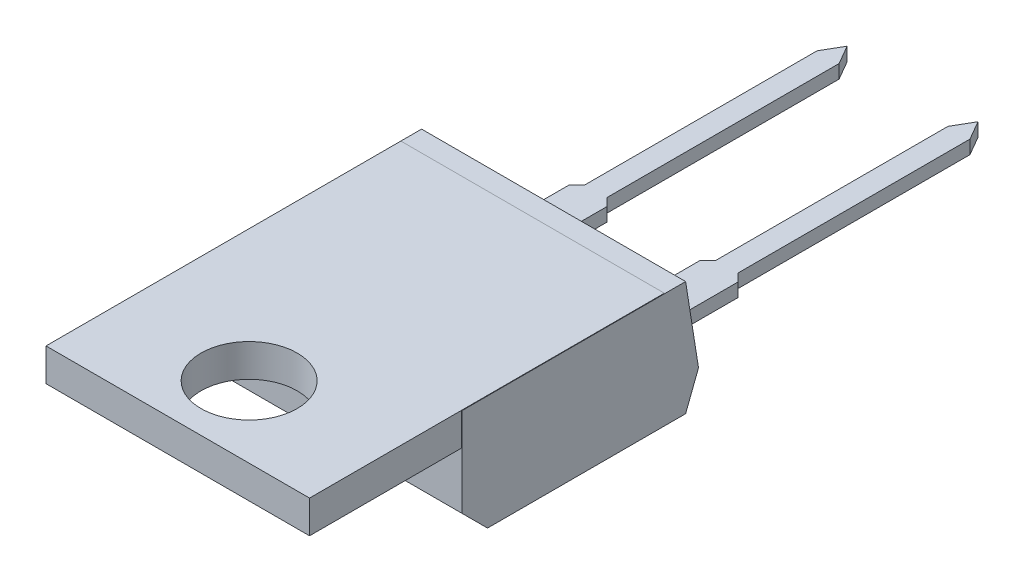
ISO-10303-21;
HEADER;
FILE_DESCRIPTION(('STEP AP214'),'2;1');
FILE_NAME('part.step','',(''),(''),'','','');
FILE_SCHEMA(('AUTOMOTIVE_DESIGN { 1 0 10303 214 1 1 1 1 }'));
ENDSEC;
DATA;
#1=APPLICATION_CONTEXT('core data for automotive mechanical design processes');
#2=APPLICATION_PROTOCOL_DEFINITION('international standard','automotive_design',2000,#1);
#3=PRODUCT_CONTEXT('',#1,'mechanical');
#4=PRODUCT('Part','Part','',(#3));
#5=PRODUCT_RELATED_PRODUCT_CATEGORY('part','',(#4));
#6=PRODUCT_DEFINITION_FORMATION('','',#4);
#7=PRODUCT_DEFINITION_CONTEXT('part definition',#1,'design');
#8=PRODUCT_DEFINITION('design','',#6,#7);
#9=PRODUCT_DEFINITION_SHAPE('','',#8);
#10=(LENGTH_UNIT() NAMED_UNIT(*) SI_UNIT(.MILLI.,.METRE.));
#11=(NAMED_UNIT(*) PLANE_ANGLE_UNIT() SI_UNIT($,.RADIAN.));
#12=(NAMED_UNIT(*) SI_UNIT($,.STERADIAN.) SOLID_ANGLE_UNIT());
#13=UNCERTAINTY_MEASURE_WITH_UNIT(LENGTH_MEASURE(1.E-05),#10,'distance_accuracy_value','');
#14=(GEOMETRIC_REPRESENTATION_CONTEXT(3) GLOBAL_UNCERTAINTY_ASSIGNED_CONTEXT((#13)) GLOBAL_UNIT_ASSIGNED_CONTEXT((#10,
#11,#12)) REPRESENTATION_CONTEXT('',''));
#15=CARTESIAN_POINT('',(0.,0.,0.));
#16=DIRECTION('',(0.,0.,1.));
#17=DIRECTION('',(1.,0.,0.));
#18=AXIS2_PLACEMENT_3D('',#15,#16,#17);
#19=CARTESIAN_POINT('',(-0.73,0.2625,0.302499999998));
#20=DIRECTION('',(0.,-1.,0.));
#21=DIRECTION('',(0.,0.,-1.));
#22=AXIS2_PLACEMENT_3D('',#19,#20,#21);
#23=PLANE('',#22);
#24=DIRECTION('',(0.,0.,1.));
#25=VECTOR('',#24,1.);
#26=CARTESIAN_POINT('',(0.73,0.2625,0.302499999998));
#27=LINE('',#26,#25);
#28=CARTESIAN_POINT('',(0.73,0.262500000000055,3.72666666666666));
#29=VERTEX_POINT('',#28);
#30=CARTESIAN_POINT('',(0.730000000000017,0.2625,0.302499999997983));
#31=VERTEX_POINT('',#30);
#32=EDGE_CURVE('E299',#29,#31,#27,.F.);
#33=ORIENTED_EDGE('',*,*,#32,.T.);
#34=DIRECTION('',(0.707106781189048,0.,0.707106781184048));
#35=VECTOR('',#34,1.);
#36=CARTESIAN_POINT('',(0.4275,0.2625,0.));
#37=LINE('',#36,#35);
#38=CARTESIAN_POINT('',(0.4275,0.2625,0.));
#39=VERTEX_POINT('',#38);
#40=EDGE_CURVE('E301',#31,#39,#37,.F.);
#41=ORIENTED_EDGE('',*,*,#40,.T.);
#42=DIRECTION('',(0.,0.,1.));
#43=VECTOR('',#42,1.);
#44=CARTESIAN_POINT('',(0.4275,0.2625,-9.009548279765));
#45=LINE('',#44,#43);
#46=CARTESIAN_POINT('',(0.427499999999931,0.262499999999999,-9.00954827976496));
#47=VERTEX_POINT('',#46);
#48=EDGE_CURVE('E306',#39,#47,#45,.F.);
#49=ORIENTED_EDGE('',*,*,#48,.T.);
#50=DIRECTION('',(0.50000000000019,0.,0.866025403784329));
#51=VECTOR('',#50,1.);
#52=CARTESIAN_POINT('',(0.,0.2625,-9.75));
#53=LINE('',#52,#51);
#54=CARTESIAN_POINT('',(0.,0.262499999999998,-9.75000000000004));
#55=VERTEX_POINT('',#54);
#56=EDGE_CURVE('E311',#47,#55,#53,.F.);
#57=ORIENTED_EDGE('',*,*,#56,.T.);
#58=DIRECTION('',(0.50000000000019,0.,-0.866025403784329));
#59=VECTOR('',#58,1.);
#60=CARTESIAN_POINT('',(-0.4275,0.2625,-9.009548279765));
#61=LINE('',#60,#59);
#62=CARTESIAN_POINT('',(-0.4275,0.262499999999999,-9.009548279765));
#63=VERTEX_POINT('',#62);
#64=EDGE_CURVE('E251',#55,#63,#61,.F.);
#65=ORIENTED_EDGE('',*,*,#64,.T.);
#66=DIRECTION('',(0.,0.,-1.));
#67=VECTOR('',#66,1.);
#68=CARTESIAN_POINT('',(-0.4275,0.2625,0.));
#69=LINE('',#68,#67);
#70=CARTESIAN_POINT('',(-0.427499999999965,0.2625,0.));
#71=VERTEX_POINT('',#70);
#72=EDGE_CURVE('E234',#63,#71,#69,.F.);
#73=ORIENTED_EDGE('',*,*,#72,.T.);
#74=DIRECTION('',(0.707106781189048,0.,-0.707106781184048));
#75=VECTOR('',#74,1.);
#76=CARTESIAN_POINT('',(-0.73,0.2625,0.302499999998));
#77=LINE('',#76,#75);
#78=CARTESIAN_POINT('',(-0.73,0.2625,0.302499999998));
#79=VERTEX_POINT('',#78);
#80=EDGE_CURVE('E239',#71,#79,#77,.F.);
#81=ORIENTED_EDGE('',*,*,#80,.T.);
#82=DIRECTION('',(0.,0.,-1.));
#83=VECTOR('',#82,1.);
#84=CARTESIAN_POINT('',(-0.73,0.2625,3.73));
#85=LINE('',#84,#83);
#86=CARTESIAN_POINT('',(-0.73,0.262500000000055,3.72666666666666));
#87=VERTEX_POINT('',#86);
#88=EDGE_CURVE('E275',#79,#87,#85,.F.);
#89=ORIENTED_EDGE('',*,*,#88,.T.);
#90=DIRECTION('',(1.,0.,0.));
#91=VECTOR('',#90,1.);
#92=CARTESIAN_POINT('',(-0.73,0.262500000000002,3.726666666667));
#93=LINE('',#92,#91);
#94=EDGE_CURVE('E263',#29,#87,#93,.F.);
#95=ORIENTED_EDGE('',*,*,#94,.F.);
#96=EDGE_LOOP('',(#33,#41,#49,#57,#65,#73,#81,#89,#95));
#97=FACE_BOUND('',#96,.T.);
#98=ADVANCED_FACE('F16',(#97),#23,.F.);
#99=CARTESIAN_POINT('',(4.35,0.2625,0.3025));
#100=DIRECTION('',(0.,-1.,0.));
#101=DIRECTION('',(0.,0.,-1.));
#102=AXIS2_PLACEMENT_3D('',#99,#100,#101);
#103=PLANE('',#102);
#104=DIRECTION('',(0.,0.,1.));
#105=VECTOR('',#104,1.);
#106=CARTESIAN_POINT('',(5.81,0.2625,0.3025));
#107=LINE('',#106,#105);
#108=CARTESIAN_POINT('',(5.81,0.262500000000055,3.72666666666666));
#109=VERTEX_POINT('',#108);
#110=CARTESIAN_POINT('',(5.81,0.2625,0.3025));
#111=VERTEX_POINT('',#110);
#112=EDGE_CURVE('E355',#109,#111,#107,.F.);
#113=ORIENTED_EDGE('',*,*,#112,.T.);
#114=DIRECTION('',(0.707106781186548,0.,0.707106781186548));
#115=VECTOR('',#114,1.);
#116=CARTESIAN_POINT('',(5.5075,0.2625,0.));
#117=LINE('',#116,#115);
#118=CARTESIAN_POINT('',(5.5075,0.2625,0.));
#119=VERTEX_POINT('',#118);
#120=EDGE_CURVE('E357',#111,#119,#117,.F.);
#121=ORIENTED_EDGE('',*,*,#120,.T.);
#122=DIRECTION('',(0.,0.,1.));
#123=VECTOR('',#122,1.);
#124=CARTESIAN_POINT('',(5.5075,0.2625,-9.009548279765));
#125=LINE('',#124,#123);
#126=CARTESIAN_POINT('',(5.50749999999993,0.262499999999999,-9.00954827976496));
#127=VERTEX_POINT('',#126);
#128=EDGE_CURVE('E362',#119,#127,#125,.F.);
#129=ORIENTED_EDGE('',*,*,#128,.T.);
#130=DIRECTION('',(0.50000000000019,0.,0.866025403784329));
#131=VECTOR('',#130,1.);
#132=CARTESIAN_POINT('',(5.08,0.2625,-9.75));
#133=LINE('',#132,#131);
#134=CARTESIAN_POINT('',(5.07999999999993,0.262499999999998,-9.75000000000004));
#135=VERTEX_POINT('',#134);
#136=EDGE_CURVE('E367',#127,#135,#133,.F.);
#137=ORIENTED_EDGE('',*,*,#136,.T.);
#138=DIRECTION('',(0.50000000000019,0.,-0.866025403784329));
#139=VECTOR('',#138,1.);
#140=CARTESIAN_POINT('',(4.6525,0.2625,-9.009548279765));
#141=LINE('',#140,#139);
#142=CARTESIAN_POINT('',(4.6525,0.262499999999999,-9.009548279765));
#143=VERTEX_POINT('',#142);
#144=EDGE_CURVE('E372',#135,#143,#141,.F.);
#145=ORIENTED_EDGE('',*,*,#144,.T.);
#146=DIRECTION('',(0.,0.,-1.));
#147=VECTOR('',#146,1.);
#148=CARTESIAN_POINT('',(4.6525,0.2625,0.));
#149=LINE('',#148,#147);
#150=CARTESIAN_POINT('',(4.6525,0.2625,0.));
#151=VERTEX_POINT('',#150);
#152=EDGE_CURVE('E377',#143,#151,#149,.F.);
#153=ORIENTED_EDGE('',*,*,#152,.T.);
#154=DIRECTION('',(0.707106781186548,0.,-0.707106781186548));
#155=VECTOR('',#154,1.);
#156=CARTESIAN_POINT('',(4.35,0.2625,0.3025));
#157=LINE('',#156,#155);
#158=CARTESIAN_POINT('',(4.35,0.2625,0.3025));
#159=VERTEX_POINT('',#158);
#160=EDGE_CURVE('E282',#151,#159,#157,.F.);
#161=ORIENTED_EDGE('',*,*,#160,.T.);
#162=DIRECTION('',(0.,0.,-1.));
#163=VECTOR('',#162,1.);
#164=CARTESIAN_POINT('',(4.35,0.2625,3.73));
#165=LINE('',#164,#163);
#166=CARTESIAN_POINT('',(4.35,0.262500000000055,3.72666666666666));
#167=VERTEX_POINT('',#166);
#168=EDGE_CURVE('E336',#159,#167,#165,.F.);
#169=ORIENTED_EDGE('',*,*,#168,.T.);
#170=DIRECTION('',(1.,0.,0.));
#171=VECTOR('',#170,1.);
#172=CARTESIAN_POINT('',(4.35,0.262500000000002,3.726666666667));
#173=LINE('',#172,#171);
#174=EDGE_CURVE('E248',#109,#167,#173,.F.);
#175=ORIENTED_EDGE('',*,*,#174,.F.);
#176=EDGE_LOOP('',(#113,#121,#129,#137,#145,#153,#161,#169,#175));
#177=FACE_BOUND('',#176,.T.);
#178=ADVANCED_FACE('F654',(#177),#103,.F.);
#179=CARTESIAN_POINT('',(-0.73,0.2625,0.302499999998));
#180=DIRECTION('',(0.707106781184048,0.,0.707106781189048));
#181=DIRECTION('',(0.707106781189048,0.,-0.707106781184048));
#182=AXIS2_PLACEMENT_3D('',#179,#180,#181);
#183=PLANE('',#182);
#184=DIRECTION('',(0.,1.,0.));
#185=VECTOR('',#184,1.);
#186=CARTESIAN_POINT('',(-0.4275,0.2625,0.));
#187=LINE('',#186,#185);
#188=CARTESIAN_POINT('',(-0.427499999999965,-0.2625,0.));
#189=VERTEX_POINT('',#188);
#190=EDGE_CURVE('E241',#71,#189,#187,.F.);
#191=ORIENTED_EDGE('',*,*,#190,.T.);
#192=DIRECTION('',(0.707106781188885,0.,-0.70710678118421));
#193=VECTOR('',#192,1.);
#194=CARTESIAN_POINT('',(-0.73,-0.2625,0.302499999998));
#195=LINE('',#194,#193);
#196=CARTESIAN_POINT('',(-0.73,-0.2625,0.302499999998));
#197=VERTEX_POINT('',#196);
#198=EDGE_CURVE('E329',#197,#189,#195,.T.);
#199=ORIENTED_EDGE('',*,*,#198,.F.);
#200=DIRECTION('',(0.,1.,0.));
#201=VECTOR('',#200,1.);
#202=CARTESIAN_POINT('',(-0.73,0.2625,0.302499999998));
#203=LINE('',#202,#201);
#204=EDGE_CURVE('E244',#197,#79,#203,.T.);
#205=ORIENTED_EDGE('',*,*,#204,.T.);
#206=ORIENTED_EDGE('',*,*,#80,.F.);
#207=EDGE_LOOP('',(#191,#199,#205,#206));
#208=FACE_BOUND('',#207,.T.);
#209=ADVANCED_FACE('F240',(#208),#183,.F.);
#210=CARTESIAN_POINT('',(-0.4275,0.2625,0.));
#211=DIRECTION('',(1.,0.,0.));
#212=DIRECTION('',(0.,0.,-1.));
#213=AXIS2_PLACEMENT_3D('',#210,#211,#212);
#214=PLANE('',#213);
#215=DIRECTION('',(0.,1.,0.));
#216=VECTOR('',#215,1.);
#217=CARTESIAN_POINT('',(-0.4275,0.2625,-9.009548279765));
#218=LINE('',#217,#216);
#219=CARTESIAN_POINT('',(-0.4275,-0.262500000000002,-9.009548279765));
#220=VERTEX_POINT('',#219);
#221=EDGE_CURVE('E253',#63,#220,#218,.F.);
#222=ORIENTED_EDGE('',*,*,#221,.T.);
#223=DIRECTION('',(0.,0.,-1.));
#224=VECTOR('',#223,1.);
#225=CARTESIAN_POINT('',(-0.4275,-0.2625,0.302499999998));
#226=LINE('',#225,#224);
#227=EDGE_CURVE('E257',#189,#220,#226,.T.);
#228=ORIENTED_EDGE('',*,*,#227,.F.);
#229=ORIENTED_EDGE('',*,*,#190,.F.);
#230=ORIENTED_EDGE('',*,*,#72,.F.);
#231=EDGE_LOOP('',(#222,#228,#229,#230));
#232=FACE_BOUND('',#231,.T.);
#233=ADVANCED_FACE('F255',(#232),#214,.F.);
#234=CARTESIAN_POINT('',(-0.4275,0.2625,-9.009548279765));
#235=DIRECTION('',(0.866025403784329,0.,0.50000000000019));
#236=DIRECTION('',(0.50000000000019,0.,-0.866025403784329));
#237=AXIS2_PLACEMENT_3D('',#234,#235,#236);
#238=PLANE('',#237);
#239=DIRECTION('',(0.,1.,0.));
#240=VECTOR('',#239,1.);
#241=CARTESIAN_POINT('',(0.,0.2625,-9.75));
#242=LINE('',#241,#240);
#243=CARTESIAN_POINT('',(0.,-0.262500000000002,-9.75000000000004));
#244=VERTEX_POINT('',#243);
#245=EDGE_CURVE('E313',#55,#244,#242,.F.);
#246=ORIENTED_EDGE('',*,*,#245,.T.);
#247=DIRECTION('',(0.500000000000352,0.,-0.866025403784235));
#248=VECTOR('',#247,1.);
#249=CARTESIAN_POINT('',(-0.4275,-0.262500000000006,-9.009548279765));
#250=LINE('',#249,#248);
#251=EDGE_CURVE('E318',#220,#244,#250,.T.);
#252=ORIENTED_EDGE('',*,*,#251,.F.);
#253=ORIENTED_EDGE('',*,*,#221,.F.);
#254=ORIENTED_EDGE('',*,*,#64,.F.);
#255=EDGE_LOOP('',(#246,#252,#253,#254));
#256=FACE_BOUND('',#255,.T.);
#257=ADVANCED_FACE('F319',(#256),#238,.F.);
#258=CARTESIAN_POINT('',(0.,0.2625,-9.75));
#259=DIRECTION('',(-0.866025403784329,0.,0.50000000000019));
#260=DIRECTION('',(0.50000000000019,0.,0.866025403784329));
#261=AXIS2_PLACEMENT_3D('',#258,#259,#260);
#262=PLANE('',#261);
#263=DIRECTION('',(0.,1.,0.));
#264=VECTOR('',#263,1.);
#265=CARTESIAN_POINT('',(0.4275,0.2625,-9.009548279765));
#266=LINE('',#265,#264);
#267=CARTESIAN_POINT('',(0.427499999999931,-0.262500000000002,-9.00954827976496));
#268=VERTEX_POINT('',#267);
#269=EDGE_CURVE('E309',#47,#268,#266,.F.);
#270=ORIENTED_EDGE('',*,*,#269,.T.);
#271=DIRECTION('',(0.500000000000352,0.,0.866025403784235));
#272=VECTOR('',#271,1.);
#273=CARTESIAN_POINT('',(0.,-0.262500000000007,-9.75));
#274=LINE('',#273,#272);
#275=EDGE_CURVE('E324',#244,#268,#274,.T.);
#276=ORIENTED_EDGE('',*,*,#275,.F.);
#277=ORIENTED_EDGE('',*,*,#245,.F.);
#278=ORIENTED_EDGE('',*,*,#56,.F.);
#279=EDGE_LOOP('',(#270,#276,#277,#278));
#280=FACE_BOUND('',#279,.T.);
#281=ADVANCED_FACE('F416',(#280),#262,.F.);
#282=CARTESIAN_POINT('',(0.4275,0.2625,-9.009548279765));
#283=DIRECTION('',(-1.,0.,0.));
#284=DIRECTION('',(0.,0.,1.));
#285=AXIS2_PLACEMENT_3D('',#282,#283,#284);
#286=PLANE('',#285);
#287=DIRECTION('',(0.,1.,0.));
#288=VECTOR('',#287,1.);
#289=CARTESIAN_POINT('',(0.4275,0.2625,0.));
#290=LINE('',#289,#288);
#291=CARTESIAN_POINT('',(0.4275,-0.2625,0.));
#292=VERTEX_POINT('',#291);
#293=EDGE_CURVE('E304',#39,#292,#290,.F.);
#294=ORIENTED_EDGE('',*,*,#293,.T.);
#295=DIRECTION('',(0.,0.,-1.));
#296=VECTOR('',#295,1.);
#297=CARTESIAN_POINT('',(0.4275,-0.2625,0.302499999998));
#298=LINE('',#297,#296);
#299=EDGE_CURVE('E412',#268,#292,#298,.F.);
#300=ORIENTED_EDGE('',*,*,#299,.F.);
#301=ORIENTED_EDGE('',*,*,#269,.F.);
#302=ORIENTED_EDGE('',*,*,#48,.F.);
#303=EDGE_LOOP('',(#294,#300,#301,#302));
#304=FACE_BOUND('',#303,.T.);
#305=ADVANCED_FACE('F419',(#304),#286,.F.);
#306=CARTESIAN_POINT('',(0.4275,0.2625,0.));
#307=DIRECTION('',(-0.707106781184048,0.,0.707106781189048));
#308=DIRECTION('',(0.707106781189048,0.,0.707106781184048));
#309=AXIS2_PLACEMENT_3D('',#306,#307,#308);
#310=PLANE('',#309);
#311=DIRECTION('',(0.,1.,0.));
#312=VECTOR('',#311,1.);
#313=CARTESIAN_POINT('',(0.73,0.2625,0.302499999998));
#314=LINE('',#313,#312);
#315=CARTESIAN_POINT('',(0.730000000000035,-0.2625,0.302499999997965));
#316=VERTEX_POINT('',#315);
#317=EDGE_CURVE('E297',#31,#316,#314,.F.);
#318=ORIENTED_EDGE('',*,*,#317,.T.);
#319=DIRECTION('',(0.707106781188885,0.,0.70710678118421));
#320=VECTOR('',#319,1.);
#321=CARTESIAN_POINT('',(0.4275,-0.2625,0.));
#322=LINE('',#321,#320);
#323=EDGE_CURVE('E409',#292,#316,#322,.T.);
#324=ORIENTED_EDGE('',*,*,#323,.F.);
#325=ORIENTED_EDGE('',*,*,#293,.F.);
#326=ORIENTED_EDGE('',*,*,#40,.F.);
#327=EDGE_LOOP('',(#318,#324,#325,#326));
#328=FACE_BOUND('',#327,.T.);
#329=ADVANCED_FACE('F424',(#328),#310,.F.);
#330=CARTESIAN_POINT('',(0.73,0.2625,0.302499999998));
#331=DIRECTION('',(-1.,0.,0.));
#332=DIRECTION('',(0.,0.,1.));
#333=AXIS2_PLACEMENT_3D('',#330,#331,#332);
#334=PLANE('',#333);
#335=DIRECTION('',(0.,0.932880669323476,-0.360185586611379));
#336=VECTOR('',#335,1.);
#337=CARTESIAN_POINT('',(0.73,-0.11655,3.73));
#338=LINE('',#337,#336);
#339=CARTESIAN_POINT('',(0.73,-0.116550000000006,3.72999999999998));
#340=VERTEX_POINT('',#339);
#341=CARTESIAN_POINT('',(0.730000000000001,0.,3.68499999999972));
#342=VERTEX_POINT('',#341);
#343=EDGE_CURVE('E293',#340,#342,#338,.T.);
#344=ORIENTED_EDGE('',*,*,#343,.F.);
#345=DIRECTION('',(0.,1.,0.));
#346=VECTOR('',#345,1.);
#347=CARTESIAN_POINT('',(0.73,0.2625,3.73));
#348=LINE('',#347,#346);
#349=CARTESIAN_POINT('',(0.73,-0.2625,3.73));
#350=VERTEX_POINT('',#349);
#351=EDGE_CURVE('E295',#350,#340,#348,.T.);
#352=ORIENTED_EDGE('',*,*,#351,.F.);
#353=DIRECTION('',(0.,0.,-1.));
#354=VECTOR('',#353,1.);
#355=CARTESIAN_POINT('',(0.73,-0.2625,0.302499999998));
#356=LINE('',#355,#354);
#357=EDGE_CURVE('E403',#316,#350,#356,.F.);
#358=ORIENTED_EDGE('',*,*,#357,.F.);
#359=ORIENTED_EDGE('',*,*,#317,.F.);
#360=ORIENTED_EDGE('',*,*,#32,.F.);
#361=DIRECTION('',(0.,0.987635528464269,0.156767544201932));
#362=VECTOR('',#361,1.);
#363=CARTESIAN_POINT('',(0.73,0.,3.685));
#364=LINE('',#363,#362);
#365=EDGE_CURVE('E273',#342,#29,#364,.T.);
#366=ORIENTED_EDGE('',*,*,#365,.F.);
#367=EDGE_LOOP('',(#344,#352,#358,#359,#360,#366));
#368=FACE_BOUND('',#367,.T.);
#369=ADVANCED_FACE('F684',(#368),#334,.F.);
#370=CARTESIAN_POINT('',(-0.73,0.2625,3.73));
#371=DIRECTION('',(1.,0.,0.));
#372=DIRECTION('',(0.,0.,-1.));
#373=AXIS2_PLACEMENT_3D('',#370,#371,#372);
#374=PLANE('',#373);
#375=ORIENTED_EDGE('',*,*,#88,.F.);
#376=ORIENTED_EDGE('',*,*,#204,.F.);
#377=DIRECTION('',(0.,0.,-1.));
#378=VECTOR('',#377,1.);
#379=CARTESIAN_POINT('',(-0.73,-0.2625,0.302499999998));
#380=LINE('',#379,#378);
#381=CARTESIAN_POINT('',(-0.73,-0.2625,3.73));
#382=VERTEX_POINT('',#381);
#383=EDGE_CURVE('E401',#382,#197,#380,.T.);
#384=ORIENTED_EDGE('',*,*,#383,.F.);
#385=DIRECTION('',(0.,1.,0.));
#386=VECTOR('',#385,1.);
#387=CARTESIAN_POINT('',(-0.73,0.2625,3.73));
#388=LINE('',#387,#386);
#389=CARTESIAN_POINT('',(-0.73,-0.116550000000006,3.72999999999998));
#390=VERTEX_POINT('',#389);
#391=EDGE_CURVE('E289',#390,#382,#388,.F.);
#392=ORIENTED_EDGE('',*,*,#391,.F.);
#393=DIRECTION('',(0.,-0.932880669323476,0.360185586611379));
#394=VECTOR('',#393,1.);
#395=CARTESIAN_POINT('',(-0.73,0.,3.685));
#396=LINE('',#395,#394);
#397=CARTESIAN_POINT('',(-0.73,0.,3.68499999999972));
#398=VERTEX_POINT('',#397);
#399=EDGE_CURVE('E281',#398,#390,#396,.T.);
#400=ORIENTED_EDGE('',*,*,#399,.F.);
#401=DIRECTION('',(0.,-0.987635528464269,-0.156767544201932));
#402=VECTOR('',#401,1.);
#403=CARTESIAN_POINT('',(-0.73,0.2625,3.726666666667));
#404=LINE('',#403,#402);
#405=EDGE_CURVE('E269',#87,#398,#404,.T.);
#406=ORIENTED_EDGE('',*,*,#405,.F.);
#407=EDGE_LOOP('',(#375,#376,#384,#392,#400,#406));
#408=FACE_BOUND('',#407,.T.);
#409=ADVANCED_FACE('F279',(#408),#374,.F.);
#410=CARTESIAN_POINT('',(4.35,0.2625,0.3025));
#411=DIRECTION('',(0.707106781186548,0.,0.707106781186548));
#412=DIRECTION('',(0.707106781186548,0.,-0.707106781186548));
#413=AXIS2_PLACEMENT_3D('',#410,#411,#412);
#414=PLANE('',#413);
#415=DIRECTION('',(0.,1.,0.));
#416=VECTOR('',#415,1.);
#417=CARTESIAN_POINT('',(4.6525,0.2625,0.));
#418=LINE('',#417,#416);
#419=CARTESIAN_POINT('',(4.6525,-0.2625,0.));
#420=VERTEX_POINT('',#419);
#421=EDGE_CURVE('E284',#151,#420,#418,.F.);
#422=ORIENTED_EDGE('',*,*,#421,.T.);
#423=DIRECTION('',(0.707106781186549,0.,-0.707106781186547));
#424=VECTOR('',#423,1.);
#425=CARTESIAN_POINT('',(4.35,-0.2625,0.3025));
#426=LINE('',#425,#424);
#427=CARTESIAN_POINT('',(4.35,-0.2625,0.3025));
#428=VERTEX_POINT('',#427);
#429=EDGE_CURVE('E384',#428,#420,#426,.T.);
#430=ORIENTED_EDGE('',*,*,#429,.F.);
#431=DIRECTION('',(0.,1.,0.));
#432=VECTOR('',#431,1.);
#433=CARTESIAN_POINT('',(4.35,0.2625,0.3025));
#434=LINE('',#433,#432);
#435=EDGE_CURVE('E339',#428,#159,#434,.T.);
#436=ORIENTED_EDGE('',*,*,#435,.T.);
#437=ORIENTED_EDGE('',*,*,#160,.F.);
#438=EDGE_LOOP('',(#422,#430,#436,#437));
#439=FACE_BOUND('',#438,.T.);
#440=ADVANCED_FACE('F382',(#439),#414,.F.);
#441=CARTESIAN_POINT('',(4.6525,0.2625,0.));
#442=DIRECTION('',(1.,0.,0.));
#443=DIRECTION('',(0.,0.,-1.));
#444=AXIS2_PLACEMENT_3D('',#441,#442,#443);
#445=PLANE('',#444);
#446=DIRECTION('',(0.,1.,0.));
#447=VECTOR('',#446,1.);
#448=CARTESIAN_POINT('',(4.6525,0.2625,-9.009548279765));
#449=LINE('',#448,#447);
#450=CARTESIAN_POINT('',(4.6525,-0.262500000000002,-9.009548279765));
#451=VERTEX_POINT('',#450);
#452=EDGE_CURVE('E375',#143,#451,#449,.F.);
#453=ORIENTED_EDGE('',*,*,#452,.T.);
#454=DIRECTION('',(0.,0.,-1.));
#455=VECTOR('',#454,1.);
#456=CARTESIAN_POINT('',(4.6525,-0.2625,0.3025));
#457=LINE('',#456,#455);
#458=EDGE_CURVE('E388',#420,#451,#457,.T.);
#459=ORIENTED_EDGE('',*,*,#458,.F.);
#460=ORIENTED_EDGE('',*,*,#421,.F.);
#461=ORIENTED_EDGE('',*,*,#152,.F.);
#462=EDGE_LOOP('',(#453,#459,#460,#461));
#463=FACE_BOUND('',#462,.T.);
#464=ADVANCED_FACE('F389',(#463),#445,.F.);
#465=CARTESIAN_POINT('',(4.6525,0.2625,-9.009548279765));
#466=DIRECTION('',(0.866025403784329,0.,0.50000000000019));
#467=DIRECTION('',(0.50000000000019,0.,-0.866025403784329));
#468=AXIS2_PLACEMENT_3D('',#465,#466,#467);
#469=PLANE('',#468);
#470=DIRECTION('',(0.,1.,0.));
#471=VECTOR('',#470,1.);
#472=CARTESIAN_POINT('',(5.08,0.2625,-9.75));
#473=LINE('',#472,#471);
#474=CARTESIAN_POINT('',(5.07999999999993,-0.262500000000002,-9.75000000000004));
#475=VERTEX_POINT('',#474);
#476=EDGE_CURVE('E370',#135,#475,#473,.F.);
#477=ORIENTED_EDGE('',*,*,#476,.T.);
#478=DIRECTION('',(0.500000000000352,0.,-0.866025403784235));
#479=VECTOR('',#478,1.);
#480=CARTESIAN_POINT('',(4.6525,-0.262500000000006,-9.009548279765));
#481=LINE('',#480,#479);
#482=EDGE_CURVE('E394',#451,#475,#481,.T.);
#483=ORIENTED_EDGE('',*,*,#482,.F.);
#484=ORIENTED_EDGE('',*,*,#452,.F.);
#485=ORIENTED_EDGE('',*,*,#144,.F.);
#486=EDGE_LOOP('',(#477,#483,#484,#485));
#487=FACE_BOUND('',#486,.T.);
#488=ADVANCED_FACE('F455',(#487),#469,.F.);
#489=CARTESIAN_POINT('',(5.08,0.2625,-9.75));
#490=DIRECTION('',(-0.866025403784329,0.,0.50000000000019));
#491=DIRECTION('',(0.50000000000019,0.,0.866025403784329));
#492=AXIS2_PLACEMENT_3D('',#489,#490,#491);
#493=PLANE('',#492);
#494=DIRECTION('',(0.,1.,0.));
#495=VECTOR('',#494,1.);
#496=CARTESIAN_POINT('',(5.5075,0.2625,-9.009548279765));
#497=LINE('',#496,#495);
#498=CARTESIAN_POINT('',(5.50749999999993,-0.262500000000002,-9.00954827976496));
#499=VERTEX_POINT('',#498);
#500=EDGE_CURVE('E365',#127,#499,#497,.F.);
#501=ORIENTED_EDGE('',*,*,#500,.T.);
#502=DIRECTION('',(0.500000000000352,0.,0.866025403784235));
#503=VECTOR('',#502,1.);
#504=CARTESIAN_POINT('',(5.08,-0.262500000000007,-9.75));
#505=LINE('',#504,#503);
#506=EDGE_CURVE('E451',#475,#499,#505,.T.);
#507=ORIENTED_EDGE('',*,*,#506,.F.);
#508=ORIENTED_EDGE('',*,*,#476,.F.);
#509=ORIENTED_EDGE('',*,*,#136,.F.);
#510=EDGE_LOOP('',(#501,#507,#508,#509));
#511=FACE_BOUND('',#510,.T.);
#512=ADVANCED_FACE('F458',(#511),#493,.F.);
#513=CARTESIAN_POINT('',(5.5075,0.2625,-9.009548279765));
#514=DIRECTION('',(-1.,0.,0.));
#515=DIRECTION('',(0.,0.,1.));
#516=AXIS2_PLACEMENT_3D('',#513,#514,#515);
#517=PLANE('',#516);
#518=DIRECTION('',(0.,1.,0.));
#519=VECTOR('',#518,1.);
#520=CARTESIAN_POINT('',(5.5075,0.2625,0.));
#521=LINE('',#520,#519);
#522=CARTESIAN_POINT('',(5.5075,-0.2625,0.));
#523=VERTEX_POINT('',#522);
#524=EDGE_CURVE('E360',#119,#523,#521,.F.);
#525=ORIENTED_EDGE('',*,*,#524,.T.);
#526=DIRECTION('',(0.,0.,-1.));
#527=VECTOR('',#526,1.);
#528=CARTESIAN_POINT('',(5.5075,-0.2625,0.3025));
#529=LINE('',#528,#527);
#530=EDGE_CURVE('E448',#499,#523,#529,.F.);
#531=ORIENTED_EDGE('',*,*,#530,.F.);
#532=ORIENTED_EDGE('',*,*,#500,.F.);
#533=ORIENTED_EDGE('',*,*,#128,.F.);
#534=EDGE_LOOP('',(#525,#531,#532,#533));
#535=FACE_BOUND('',#534,.T.);
#536=ADVANCED_FACE('F462',(#535),#517,.F.);
#537=CARTESIAN_POINT('',(5.5075,0.2625,0.));
#538=DIRECTION('',(-0.707106781186548,0.,0.707106781186548));
#539=DIRECTION('',(0.707106781186548,0.,0.707106781186548));
#540=AXIS2_PLACEMENT_3D('',#537,#538,#539);
#541=PLANE('',#540);
#542=DIRECTION('',(0.,1.,0.));
#543=VECTOR('',#542,1.);
#544=CARTESIAN_POINT('',(5.81,0.2625,0.3025));
#545=LINE('',#544,#543);
#546=CARTESIAN_POINT('',(5.81,-0.2625,0.3025));
#547=VERTEX_POINT('',#546);
#548=EDGE_CURVE('E353',#111,#547,#545,.F.);
#549=ORIENTED_EDGE('',*,*,#548,.T.);
#550=DIRECTION('',(0.707106781186547,0.,0.707106781186548));
#551=VECTOR('',#550,1.);
#552=CARTESIAN_POINT('',(5.5075,-0.2625,0.));
#553=LINE('',#552,#551);
#554=EDGE_CURVE('E445',#523,#547,#553,.T.);
#555=ORIENTED_EDGE('',*,*,#554,.F.);
#556=ORIENTED_EDGE('',*,*,#524,.F.);
#557=ORIENTED_EDGE('',*,*,#120,.F.);
#558=EDGE_LOOP('',(#549,#555,#556,#557));
#559=FACE_BOUND('',#558,.T.);
#560=ADVANCED_FACE('F468',(#559),#541,.F.);
#561=CARTESIAN_POINT('',(5.81,0.2625,0.3025));
#562=DIRECTION('',(-1.,0.,0.));
#563=DIRECTION('',(0.,0.,1.));
#564=AXIS2_PLACEMENT_3D('',#561,#562,#563);
#565=PLANE('',#564);
#566=DIRECTION('',(0.,0.932880669323476,-0.360185586611379));
#567=VECTOR('',#566,1.);
#568=CARTESIAN_POINT('',(5.81,-0.11655,3.73));
#569=LINE('',#568,#567);
#570=CARTESIAN_POINT('',(5.81,-0.116550000000006,3.72999999999998));
#571=VERTEX_POINT('',#570);
#572=CARTESIAN_POINT('',(5.81,0.,3.68499999999972));
#573=VERTEX_POINT('',#572);
#574=EDGE_CURVE('E349',#571,#573,#569,.T.);
#575=ORIENTED_EDGE('',*,*,#574,.F.);
#576=DIRECTION('',(0.,1.,0.));
#577=VECTOR('',#576,1.);
#578=CARTESIAN_POINT('',(5.81,0.2625,3.73));
#579=LINE('',#578,#577);
#580=CARTESIAN_POINT('',(5.81,-0.2625,3.73));
#581=VERTEX_POINT('',#580);
#582=EDGE_CURVE('E351',#581,#571,#579,.T.);
#583=ORIENTED_EDGE('',*,*,#582,.F.);
#584=DIRECTION('',(0.,0.,-1.));
#585=VECTOR('',#584,1.);
#586=CARTESIAN_POINT('',(5.81,-0.2625,0.3025));
#587=LINE('',#586,#585);
#588=EDGE_CURVE('E439',#547,#581,#587,.F.);
#589=ORIENTED_EDGE('',*,*,#588,.F.);
#590=ORIENTED_EDGE('',*,*,#548,.F.);
#591=ORIENTED_EDGE('',*,*,#112,.F.);
#592=DIRECTION('',(0.,0.987635528464269,0.156767544201932));
#593=VECTOR('',#592,1.);
#594=CARTESIAN_POINT('',(5.81,0.,3.685));
#595=LINE('',#594,#593);
#596=EDGE_CURVE('E346',#573,#109,#595,.T.);
#597=ORIENTED_EDGE('',*,*,#596,.F.);
#598=EDGE_LOOP('',(#575,#583,#589,#590,#591,#597));
#599=FACE_BOUND('',#598,.T.);
#600=ADVANCED_FACE('F474',(#599),#565,.F.);
#601=CARTESIAN_POINT('',(4.35,0.2625,3.73));
#602=DIRECTION('',(1.,0.,0.));
#603=DIRECTION('',(0.,0.,-1.));
#604=AXIS2_PLACEMENT_3D('',#601,#602,#603);
#605=PLANE('',#604);
#606=ORIENTED_EDGE('',*,*,#168,.F.);
#607=ORIENTED_EDGE('',*,*,#435,.F.);
#608=DIRECTION('',(0.,0.,-1.));
#609=VECTOR('',#608,1.);
#610=CARTESIAN_POINT('',(4.35,-0.2625,0.3025));
#611=LINE('',#610,#609);
#612=CARTESIAN_POINT('',(4.35,-0.2625,3.73));
#613=VERTEX_POINT('',#612);
#614=EDGE_CURVE('E400',#613,#428,#611,.T.);
#615=ORIENTED_EDGE('',*,*,#614,.F.);
#616=DIRECTION('',(0.,1.,0.));
#617=VECTOR('',#616,1.);
#618=CARTESIAN_POINT('',(4.35,0.2625,3.73));
#619=LINE('',#618,#617);
#620=CARTESIAN_POINT('',(4.35,-0.116550000000006,3.72999999999998));
#621=VERTEX_POINT('',#620);
#622=EDGE_CURVE('E342',#621,#613,#619,.F.);
#623=ORIENTED_EDGE('',*,*,#622,.F.);
#624=DIRECTION('',(0.,-0.932880669323476,0.360185586611379));
#625=VECTOR('',#624,1.);
#626=CARTESIAN_POINT('',(4.35,0.,3.685));
#627=LINE('',#626,#625);
#628=CARTESIAN_POINT('',(4.35,0.,3.68499999999972));
#629=VERTEX_POINT('',#628);
#630=EDGE_CURVE('E344',#629,#621,#627,.T.);
#631=ORIENTED_EDGE('',*,*,#630,.F.);
#632=DIRECTION('',(0.,-0.987635528464269,-0.156767544201932));
#633=VECTOR('',#632,1.);
#634=CARTESIAN_POINT('',(4.35,0.2625,3.726666666667));
#635=LINE('',#634,#633);
#636=EDGE_CURVE('E331',#167,#629,#635,.T.);
#637=ORIENTED_EDGE('',*,*,#636,.F.);
#638=EDGE_LOOP('',(#606,#607,#615,#623,#631,#637));
#639=FACE_BOUND('',#638,.T.);
#640=ADVANCED_FACE('F659',(#639),#605,.F.);
#641=CARTESIAN_POINT('',(-0.73,-0.2625,0.302499999998));
#642=DIRECTION('',(0.,-1.,0.));
#643=DIRECTION('',(0.,0.,-1.));
#644=AXIS2_PLACEMENT_3D('',#641,#642,#643);
#645=PLANE('',#644);
#646=DIRECTION('',(1.,0.,0.));
#647=VECTOR('',#646,1.);
#648=CARTESIAN_POINT('',(0.73,-0.2625,3.73));
#649=LINE('',#648,#647);
#650=EDGE_CURVE('E428',#350,#382,#649,.F.);
#651=ORIENTED_EDGE('',*,*,#650,.T.);
#652=ORIENTED_EDGE('',*,*,#383,.T.);
#653=ORIENTED_EDGE('',*,*,#198,.T.);
#654=ORIENTED_EDGE('',*,*,#227,.T.);
#655=ORIENTED_EDGE('',*,*,#251,.T.);
#656=ORIENTED_EDGE('',*,*,#275,.T.);
#657=ORIENTED_EDGE('',*,*,#299,.T.);
#658=ORIENTED_EDGE('',*,*,#323,.T.);
#659=ORIENTED_EDGE('',*,*,#357,.T.);
#660=EDGE_LOOP('',(#651,#652,#653,#654,#655,#656,#657,#658,#659));
#661=FACE_BOUND('',#660,.T.);
#662=ADVANCED_FACE('F327',(#661),#645,.T.);
#663=CARTESIAN_POINT('',(4.35,-0.2625,0.3025));
#664=DIRECTION('',(0.,-1.,0.));
#665=DIRECTION('',(0.,0.,-1.));
#666=AXIS2_PLACEMENT_3D('',#663,#664,#665);
#667=PLANE('',#666);
#668=DIRECTION('',(1.,0.,0.));
#669=VECTOR('',#668,1.);
#670=CARTESIAN_POINT('',(5.81,-0.2625,3.73));
#671=LINE('',#670,#669);
#672=EDGE_CURVE('E435',#581,#613,#671,.F.);
#673=ORIENTED_EDGE('',*,*,#672,.T.);
#674=ORIENTED_EDGE('',*,*,#614,.T.);
#675=ORIENTED_EDGE('',*,*,#429,.T.);
#676=ORIENTED_EDGE('',*,*,#458,.T.);
#677=ORIENTED_EDGE('',*,*,#482,.T.);
#678=ORIENTED_EDGE('',*,*,#506,.T.);
#679=ORIENTED_EDGE('',*,*,#530,.T.);
#680=ORIENTED_EDGE('',*,*,#554,.T.);
#681=ORIENTED_EDGE('',*,*,#588,.T.);
#682=EDGE_LOOP('',(#673,#674,#675,#676,#677,#678,#679,#680,#681));
#683=FACE_BOUND('',#682,.T.);
#684=ADVANCED_FACE('F398',(#683),#667,.T.);
#685=CARTESIAN_POINT('',(0.73,0.2625,3.73));
#686=DIRECTION('',(0.,0.,-1.));
#687=DIRECTION('',(0.,1.,0.));
#688=AXIS2_PLACEMENT_3D('',#685,#686,#687);
#689=PLANE('',#688);
#690=ORIENTED_EDGE('',*,*,#650,.F.);
#691=ORIENTED_EDGE('',*,*,#351,.T.);
#692=DIRECTION('',(1.,0.,0.));
#693=VECTOR('',#692,1.);
#694=CARTESIAN_POINT('',(-2.585,-0.116550000000024,3.72999999999994));
#695=LINE('',#694,#693);
#696=EDGE_CURVE('E437',#390,#340,#695,.T.);
#697=ORIENTED_EDGE('',*,*,#696,.F.);
#698=ORIENTED_EDGE('',*,*,#391,.T.);
#699=EDGE_LOOP('',(#690,#691,#697,#698));
#700=FACE_BOUND('',#699,.T.);
#701=ADVANCED_FACE('F431',(#700),#689,.F.);
#702=CARTESIAN_POINT('',(5.81,0.2625,3.73));
#703=DIRECTION('',(0.,0.,-1.));
#704=DIRECTION('',(0.,1.,0.));
#705=AXIS2_PLACEMENT_3D('',#702,#703,#704);
#706=PLANE('',#705);
#707=ORIENTED_EDGE('',*,*,#672,.F.);
#708=ORIENTED_EDGE('',*,*,#582,.T.);
#709=DIRECTION('',(1.,0.,0.));
#710=VECTOR('',#709,1.);
#711=CARTESIAN_POINT('',(-2.585,-0.116550000000024,3.72999999999994));
#712=LINE('',#711,#710);
#713=EDGE_CURVE('E480',#621,#571,#712,.T.);
#714=ORIENTED_EDGE('',*,*,#713,.F.);
#715=ORIENTED_EDGE('',*,*,#622,.T.);
#716=EDGE_LOOP('',(#707,#708,#714,#715));
#717=FACE_BOUND('',#716,.T.);
#718=ADVANCED_FACE('F479',(#717),#706,.F.);
#719=CARTESIAN_POINT('',(-2.585,-1.295,4.185));
#720=DIRECTION('',(0.,-1.,0.));
#721=DIRECTION('',(0.,0.,-1.));
#722=AXIS2_PLACEMENT_3D('',#719,#720,#721);
#723=PLANE('',#722);
#724=DIRECTION('',(1.,0.,0.));
#725=VECTOR('',#724,1.);
#726=CARTESIAN_POINT('',(-2.585,-1.295,11.875000000001));
#727=LINE('',#726,#725);
#728=CARTESIAN_POINT('',(-2.585,-1.295,11.875000000001));
#729=VERTEX_POINT('',#728);
#730=CARTESIAN_POINT('',(7.665,-1.295,11.875000000001));
#731=VERTEX_POINT('',#730);
#732=EDGE_CURVE('E492',#729,#731,#727,.T.);
#733=ORIENTED_EDGE('',*,*,#732,.F.);
#734=DIRECTION('',(0.,0.,-1.));
#735=VECTOR('',#734,1.);
#736=CARTESIAN_POINT('',(-2.585,-1.295,3.685));
#737=LINE('',#736,#735);
#738=CARTESIAN_POINT('',(-2.585,-1.29500000000007,4.18499999999982));
#739=VERTEX_POINT('',#738);
#740=EDGE_CURVE('E499',#729,#739,#737,.T.);
#741=ORIENTED_EDGE('',*,*,#740,.T.);
#742=DIRECTION('',(1.,0.,0.));
#743=VECTOR('',#742,1.);
#744=CARTESIAN_POINT('',(-2.585,-1.29500000000027,4.1849999999993));
#745=LINE('',#744,#743);
#746=CARTESIAN_POINT('',(7.665,-1.29500000000007,4.18499999999982));
#747=VERTEX_POINT('',#746);
#748=EDGE_CURVE('E489',#747,#739,#745,.F.);
#749=ORIENTED_EDGE('',*,*,#748,.F.);
#750=DIRECTION('',(0.,0.,-1.));
#751=VECTOR('',#750,1.);
#752=CARTESIAN_POINT('',(7.665,-1.295,3.685));
#753=LINE('',#752,#751);
#754=EDGE_CURVE('E506',#731,#747,#753,.T.);
#755=ORIENTED_EDGE('',*,*,#754,.F.);
#756=EDGE_LOOP('',(#733,#741,#749,#755));
#757=FACE_BOUND('',#756,.T.);
#758=ADVANCED_FACE('F652',(#757),#723,.T.);
#759=CARTESIAN_POINT('',(-2.585,0.,3.685));
#760=DIRECTION('',(0.,-0.360185586610873,-0.932880669323672));
#761=DIRECTION('',(0.,0.932880669323672,-0.360185586610873));
#762=AXIS2_PLACEMENT_3D('',#759,#760,#761);
#763=PLANE('',#762);
#764=DIRECTION('',(0.,0.932880669323476,-0.36018558661138));
#765=VECTOR('',#764,1.);
#766=CARTESIAN_POINT('',(7.665,-1.295,4.185));
#767=LINE('',#766,#765);
#768=CARTESIAN_POINT('',(7.665,0.,3.68499999999972));
#769=VERTEX_POINT('',#768);
#770=EDGE_CURVE('E509',#747,#769,#767,.T.);
#771=ORIENTED_EDGE('',*,*,#770,.F.);
#772=ORIENTED_EDGE('',*,*,#748,.T.);
#773=DIRECTION('',(0.,0.932880669323476,-0.36018558661138));
#774=VECTOR('',#773,1.);
#775=CARTESIAN_POINT('',(-2.585,-1.295,4.185));
#776=LINE('',#775,#774);
#777=CARTESIAN_POINT('',(-2.585,0.,3.68499999999972));
#778=VERTEX_POINT('',#777);
#779=EDGE_CURVE('E501',#739,#778,#776,.T.);
#780=ORIENTED_EDGE('',*,*,#779,.T.);
#781=DIRECTION('',(1.,0.,0.));
#782=VECTOR('',#781,1.);
#783=CARTESIAN_POINT('',(-2.585,1.80411241501588E-13,3.68499999999886));
#784=LINE('',#783,#782);
#785=EDGE_CURVE('E521',#398,#778,#784,.F.);
#786=ORIENTED_EDGE('',*,*,#785,.F.);
#787=ORIENTED_EDGE('',*,*,#399,.T.);
#788=ORIENTED_EDGE('',*,*,#696,.T.);
#789=ORIENTED_EDGE('',*,*,#343,.T.);
#790=DIRECTION('',(1.,0.,0.));
#791=VECTOR('',#790,1.);
#792=CARTESIAN_POINT('',(-2.585,1.80411241501588E-13,3.68499999999886));
#793=LINE('',#792,#791);
#794=EDGE_CURVE('E519',#629,#342,#793,.F.);
#795=ORIENTED_EDGE('',*,*,#794,.F.);
#796=ORIENTED_EDGE('',*,*,#630,.T.);
#797=ORIENTED_EDGE('',*,*,#713,.T.);
#798=ORIENTED_EDGE('',*,*,#574,.T.);
#799=DIRECTION('',(1.,0.,0.));
#800=VECTOR('',#799,1.);
#801=CARTESIAN_POINT('',(-2.585,1.80411241501588E-13,3.68499999999886));
#802=LINE('',#801,#800);
#803=EDGE_CURVE('E517',#769,#573,#802,.F.);
#804=ORIENTED_EDGE('',*,*,#803,.F.);
#805=EDGE_LOOP('',(#771,#772,#780,#786,#787,#788,#789,#795,#796,#797,#798,#804));
#806=FACE_BOUND('',#805,.T.);
#807=ADVANCED_FACE('F484',(#806),#763,.T.);
#808=CARTESIAN_POINT('',(-2.585,-1.295,11.875000000001));
#809=DIRECTION('',(0.,-0.707106781186048,0.707106781187048));
#810=DIRECTION('',(0.,-0.707106781187048,-0.707106781186048));
#811=AXIS2_PLACEMENT_3D('',#808,#809,#810);
#812=PLANE('',#811);
#813=DIRECTION('',(1.,0.,0.));
#814=VECTOR('',#813,1.);
#815=CARTESIAN_POINT('',(-2.585,-0.295,12.875));
#816=LINE('',#815,#814);
#817=CARTESIAN_POINT('',(-2.585,-0.294999999999948,12.8749999999999));
#818=VERTEX_POINT('',#817);
#819=CARTESIAN_POINT('',(7.665,-0.294999999999896,12.8749999999999));
#820=VERTEX_POINT('',#819);
#821=EDGE_CURVE('E526',#818,#820,#816,.T.);
#822=ORIENTED_EDGE('',*,*,#821,.F.);
#823=DIRECTION('',(0.,-0.707106781186901,-0.707106781186194));
#824=VECTOR('',#823,1.);
#825=CARTESIAN_POINT('',(-2.585,-0.295,12.875));
#826=LINE('',#825,#824);
#827=EDGE_CURVE('E496',#818,#729,#826,.T.);
#828=ORIENTED_EDGE('',*,*,#827,.T.);
#829=ORIENTED_EDGE('',*,*,#732,.T.);
#830=DIRECTION('',(0.,-0.707106781186901,-0.707106781186194));
#831=VECTOR('',#830,1.);
#832=CARTESIAN_POINT('',(7.665,-0.295,12.875));
#833=LINE('',#832,#831);
#834=EDGE_CURVE('E503',#820,#731,#833,.T.);
#835=ORIENTED_EDGE('',*,*,#834,.F.);
#836=EDGE_LOOP('',(#822,#828,#829,#835));
#837=FACE_BOUND('',#836,.T.);
#838=ADVANCED_FACE('F646',(#837),#812,.T.);
#839=CARTESIAN_POINT('',(-2.585,0.,3.685));
#840=DIRECTION('',(1.,0.,0.));
#841=DIRECTION('',(0.,0.,-1.));
#842=AXIS2_PLACEMENT_3D('',#839,#840,#841);
#843=PLANE('',#842);
#844=ORIENTED_EDGE('',*,*,#740,.F.);
#845=ORIENTED_EDGE('',*,*,#827,.F.);
#846=DIRECTION('',(0.,1.,0.));
#847=VECTOR('',#846,1.);
#848=CARTESIAN_POINT('',(-2.585,-0.295,12.875));
#849=LINE('',#848,#847);
#850=CARTESIAN_POINT('',(-2.585,3.15,12.875));
#851=VERTEX_POINT('',#850);
#852=EDGE_CURVE('E523',#851,#818,#849,.F.);
#853=ORIENTED_EDGE('',*,*,#852,.F.);
#854=DIRECTION('',(0.,0.,1.));
#855=VECTOR('',#854,1.);
#856=CARTESIAN_POINT('',(-2.585,3.15,12.875));
#857=LINE('',#856,#855);
#858=CARTESIAN_POINT('',(-2.585,3.15,4.185));
#859=VERTEX_POINT('',#858);
#860=EDGE_CURVE('E535',#859,#851,#857,.T.);
#861=ORIENTED_EDGE('',*,*,#860,.F.);
#862=DIRECTION('',(0.,0.987635528464406,0.156767544201065));
#863=VECTOR('',#862,1.);
#864=CARTESIAN_POINT('',(-2.585,3.15,4.185));
#865=LINE('',#864,#863);
#866=EDGE_CURVE('E511',#778,#859,#865,.T.);
#867=ORIENTED_EDGE('',*,*,#866,.F.);
#868=ORIENTED_EDGE('',*,*,#779,.F.);
#869=EDGE_LOOP('',(#844,#845,#853,#861,#867,#868));
#870=FACE_BOUND('',#869,.T.);
#871=ADVANCED_FACE('F642',(#870),#843,.F.);
#872=CARTESIAN_POINT('',(7.665,0.,3.685));
#873=DIRECTION('',(1.,0.,0.));
#874=DIRECTION('',(0.,0.,-1.));
#875=AXIS2_PLACEMENT_3D('',#872,#873,#874);
#876=PLANE('',#875);
#877=ORIENTED_EDGE('',*,*,#754,.T.);
#878=ORIENTED_EDGE('',*,*,#770,.T.);
#879=DIRECTION('',(0.,0.987635528464406,0.156767544201065));
#880=VECTOR('',#879,1.);
#881=CARTESIAN_POINT('',(7.665,3.15,4.185));
#882=LINE('',#881,#880);
#883=CARTESIAN_POINT('',(7.665,3.15,4.185));
#884=VERTEX_POINT('',#883);
#885=EDGE_CURVE('E514',#884,#769,#882,.F.);
#886=ORIENTED_EDGE('',*,*,#885,.F.);
#887=DIRECTION('',(0.,0.,1.));
#888=VECTOR('',#887,1.);
#889=CARTESIAN_POINT('',(7.665,3.15,12.875));
#890=LINE('',#889,#888);
#891=CARTESIAN_POINT('',(7.665,3.15,12.875));
#892=VERTEX_POINT('',#891);
#893=EDGE_CURVE('E544',#892,#884,#890,.F.);
#894=ORIENTED_EDGE('',*,*,#893,.F.);
#895=DIRECTION('',(0.,1.,0.));
#896=VECTOR('',#895,1.);
#897=CARTESIAN_POINT('',(7.665,-0.295,12.875));
#898=LINE('',#897,#896);
#899=EDGE_CURVE('E529',#820,#892,#898,.T.);
#900=ORIENTED_EDGE('',*,*,#899,.F.);
#901=ORIENTED_EDGE('',*,*,#834,.T.);
#902=EDGE_LOOP('',(#877,#878,#886,#894,#900,#901));
#903=FACE_BOUND('',#902,.T.);
#904=ADVANCED_FACE('F649',(#903),#876,.T.);
#905=CARTESIAN_POINT('',(-2.585,3.15,4.185));
#906=DIRECTION('',(0.,0.156767544201065,-0.987635528464406));
#907=DIRECTION('',(0.,0.987635528464406,0.156767544201065));
#908=AXIS2_PLACEMENT_3D('',#905,#906,#907);
#909=PLANE('',#908);
#910=ORIENTED_EDGE('',*,*,#405,.T.);
#911=ORIENTED_EDGE('',*,*,#785,.T.);
#912=ORIENTED_EDGE('',*,*,#866,.T.);
#913=DIRECTION('',(1.,0.,0.));
#914=VECTOR('',#913,1.);
#915=CARTESIAN_POINT('',(-2.585,3.15,4.185));
#916=LINE('',#915,#914);
#917=EDGE_CURVE('E547',#884,#859,#916,.F.);
#918=ORIENTED_EDGE('',*,*,#917,.F.);
#919=ORIENTED_EDGE('',*,*,#885,.T.);
#920=ORIENTED_EDGE('',*,*,#803,.T.);
#921=ORIENTED_EDGE('',*,*,#596,.T.);
#922=ORIENTED_EDGE('',*,*,#174,.T.);
#923=ORIENTED_EDGE('',*,*,#636,.T.);
#924=ORIENTED_EDGE('',*,*,#794,.T.);
#925=ORIENTED_EDGE('',*,*,#365,.T.);
#926=ORIENTED_EDGE('',*,*,#94,.T.);
#927=EDGE_LOOP('',(#910,#911,#912,#918,#919,#920,#921,#922,#923,#924,#925,#926));
#928=FACE_BOUND('',#927,.T.);
#929=ADVANCED_FACE('F266',(#928),#909,.T.);
#930=CARTESIAN_POINT('',(-2.585,-0.295,12.875));
#931=DIRECTION('',(0.,0.,1.));
#932=DIRECTION('',(1.,0.,0.));
#933=AXIS2_PLACEMENT_3D('',#930,#931,#932);
#934=PLANE('',#933);
#935=DIRECTION('',(0.,1.,0.));
#936=VECTOR('',#935,1.);
#937=CARTESIAN_POINT('',(-2.575,-0.295,12.875));
#938=LINE('',#937,#936);
#939=CARTESIAN_POINT('',(-2.575,1.89,12.875));
#940=VERTEX_POINT('',#939);
#941=CARTESIAN_POINT('',(-2.575,3.15,12.875));
#942=VERTEX_POINT('',#941);
#943=EDGE_CURVE('E533',#940,#942,#938,.T.);
#944=ORIENTED_EDGE('',*,*,#943,.T.);
#945=DIRECTION('',(1.,0.,0.));
#946=VECTOR('',#945,1.);
#947=CARTESIAN_POINT('',(-2.585,3.15,12.875));
#948=LINE('',#947,#946);
#949=EDGE_CURVE('E538',#851,#942,#948,.T.);
#950=ORIENTED_EDGE('',*,*,#949,.F.);
#951=ORIENTED_EDGE('',*,*,#852,.T.);
#952=ORIENTED_EDGE('',*,*,#821,.T.);
#953=ORIENTED_EDGE('',*,*,#899,.T.);
#954=DIRECTION('',(1.,0.,0.));
#955=VECTOR('',#954,1.);
#956=CARTESIAN_POINT('',(-2.585,3.15,12.875));
#957=LINE('',#956,#955);
#958=CARTESIAN_POINT('',(7.655,3.15,12.875));
#959=VERTEX_POINT('',#958);
#960=EDGE_CURVE('E541',#959,#892,#957,.T.);
#961=ORIENTED_EDGE('',*,*,#960,.F.);
#962=DIRECTION('',(0.,1.,0.));
#963=VECTOR('',#962,1.);
#964=CARTESIAN_POINT('',(7.655,-0.295,12.875));
#965=LINE('',#964,#963);
#966=CARTESIAN_POINT('',(7.655,1.89,12.875));
#967=VERTEX_POINT('',#966);
#968=EDGE_CURVE('E531',#959,#967,#965,.F.);
#969=ORIENTED_EDGE('',*,*,#968,.T.);
#970=DIRECTION('',(1.,0.,0.));
#971=VECTOR('',#970,1.);
#972=CARTESIAN_POINT('',(7.655,1.89,12.875));
#973=LINE('',#972,#971);
#974=EDGE_CURVE('E550',#940,#967,#973,.T.);
#975=ORIENTED_EDGE('',*,*,#974,.F.);
#976=EDGE_LOOP('',(#944,#950,#951,#952,#953,#961,#969,#975));
#977=FACE_BOUND('',#976,.T.);
#978=ADVANCED_FACE('F633',(#977),#934,.T.);
#979=CARTESIAN_POINT('',(-2.585,3.15,12.875));
#980=DIRECTION('',(0.,1.,0.));
#981=DIRECTION('',(0.,0.,1.));
#982=AXIS2_PLACEMENT_3D('',#979,#980,#981);
#983=PLANE('',#982);
#984=ORIENTED_EDGE('',*,*,#893,.T.);
#985=ORIENTED_EDGE('',*,*,#917,.T.);
#986=ORIENTED_EDGE('',*,*,#860,.T.);
#987=ORIENTED_EDGE('',*,*,#949,.T.);
#988=DIRECTION('',(0.,0.,1.));
#989=VECTOR('',#988,1.);
#990=CARTESIAN_POINT('',(-2.575,3.15,5.));
#991=LINE('',#990,#989);
#992=CARTESIAN_POINT('',(-2.575,3.15,5.));
#993=VERTEX_POINT('',#992);
#994=EDGE_CURVE('E555',#993,#942,#991,.T.);
#995=ORIENTED_EDGE('',*,*,#994,.F.);
#996=DIRECTION('',(1.,0.,0.));
#997=VECTOR('',#996,1.);
#998=CARTESIAN_POINT('',(-2.575,3.15,5.));
#999=LINE('',#998,#997);
#1000=CARTESIAN_POINT('',(7.655,3.15,5.));
#1001=VERTEX_POINT('',#1000);
#1002=EDGE_CURVE('E574',#993,#1001,#999,.T.);
#1003=ORIENTED_EDGE('',*,*,#1002,.T.);
#1004=DIRECTION('',(0.,0.,-1.));
#1005=VECTOR('',#1004,1.);
#1006=CARTESIAN_POINT('',(7.655,3.15,5.));
#1007=LINE('',#1006,#1005);
#1008=EDGE_CURVE('E569',#959,#1001,#1007,.T.);
#1009=ORIENTED_EDGE('',*,*,#1008,.F.);
#1010=ORIENTED_EDGE('',*,*,#960,.T.);
#1011=EDGE_LOOP('',(#984,#985,#986,#987,#995,#1003,#1009,#1010));
#1012=FACE_BOUND('',#1011,.T.);
#1013=ADVANCED_FACE('F629',(#1012),#983,.T.);
#1014=CARTESIAN_POINT('',(7.655,1.89,5.));
#1015=DIRECTION('',(0.,-1.,0.));
#1016=DIRECTION('',(0.,0.,-1.));
#1017=AXIS2_PLACEMENT_3D('',#1014,#1015,#1016);
#1018=PLANE('',#1017);
#1019=CARTESIAN_POINT('',(2.54,1.89,16.005));
#1020=DIRECTION('',(0.,-1.,0.));
#1021=DIRECTION('',(0.,0.,-1.));
#1022=AXIS2_PLACEMENT_3D('',#1019,#1020,#1021);
#1023=CIRCLE('',#1022,1.8675);
#1024=CARTESIAN_POINT('',(2.54,1.89,14.1375));
#1025=VERTEX_POINT('',#1024);
#1026=EDGE_CURVE('E19',#1025,#1025,#1023,.F.);
#1027=ORIENTED_EDGE('',*,*,#1026,.T.);
#1028=EDGE_LOOP('',(#1027));
#1029=FACE_BOUND('',#1028,.T.);
#1030=DIRECTION('',(1.,0.,0.));
#1031=VECTOR('',#1030,1.);
#1032=CARTESIAN_POINT('',(-2.575,1.89,18.775));
#1033=LINE('',#1032,#1031);
#1034=CARTESIAN_POINT('',(-2.575,1.89,18.775));
#1035=VERTEX_POINT('',#1034);
#1036=CARTESIAN_POINT('',(7.655,1.89,18.775));
#1037=VERTEX_POINT('',#1036);
#1038=EDGE_CURVE('E561',#1035,#1037,#1033,.T.);
#1039=ORIENTED_EDGE('',*,*,#1038,.F.);
#1040=DIRECTION('',(0.,0.,1.));
#1041=VECTOR('',#1040,1.);
#1042=CARTESIAN_POINT('',(-2.575,1.89,5.));
#1043=LINE('',#1042,#1041);
#1044=EDGE_CURVE('E553',#940,#1035,#1043,.T.);
#1045=ORIENTED_EDGE('',*,*,#1044,.F.);
#1046=ORIENTED_EDGE('',*,*,#974,.T.);
#1047=DIRECTION('',(0.,0.,-1.));
#1048=VECTOR('',#1047,1.);
#1049=CARTESIAN_POINT('',(7.655,1.89,5.));
#1050=LINE('',#1049,#1048);
#1051=EDGE_CURVE('E566',#1037,#967,#1050,.T.);
#1052=ORIENTED_EDGE('',*,*,#1051,.F.);
#1053=EDGE_LOOP('',(#1039,#1045,#1046,#1052));
#1054=FACE_BOUND('',#1053,.T.);
#1055=ADVANCED_FACE('F626',(#1029,#1054),#1018,.T.);
#1056=CARTESIAN_POINT('',(-2.575,1.89,5.));
#1057=DIRECTION('',(-1.,0.,0.));
#1058=DIRECTION('',(0.,0.,1.));
#1059=AXIS2_PLACEMENT_3D('',#1056,#1057,#1058);
#1060=PLANE('',#1059);
#1061=DIRECTION('',(0.,1.,0.));
#1062=VECTOR('',#1061,1.);
#1063=CARTESIAN_POINT('',(-2.575,3.16,5.));
#1064=LINE('',#1063,#1062);
#1065=CARTESIAN_POINT('',(-2.575,3.16,5.));
#1066=VERTEX_POINT('',#1065);
#1067=EDGE_CURVE('E571',#1066,#993,#1064,.F.);
#1068=ORIENTED_EDGE('',*,*,#1067,.T.);
#1069=ORIENTED_EDGE('',*,*,#994,.T.);
#1070=ORIENTED_EDGE('',*,*,#943,.F.);
#1071=ORIENTED_EDGE('',*,*,#1044,.T.);
#1072=DIRECTION('',(0.,1.,0.));
#1073=VECTOR('',#1072,1.);
#1074=CARTESIAN_POINT('',(-2.575,3.16,18.775));
#1075=LINE('',#1074,#1073);
#1076=CARTESIAN_POINT('',(-2.575,3.16,18.775));
#1077=VERTEX_POINT('',#1076);
#1078=EDGE_CURVE('E558',#1077,#1035,#1075,.F.);
#1079=ORIENTED_EDGE('',*,*,#1078,.F.);
#1080=DIRECTION('',(0.,0.,1.));
#1081=VECTOR('',#1080,1.);
#1082=CARTESIAN_POINT('',(-2.575,3.16,5.));
#1083=LINE('',#1082,#1081);
#1084=EDGE_CURVE('E577',#1066,#1077,#1083,.T.);
#1085=ORIENTED_EDGE('',*,*,#1084,.F.);
#1086=EDGE_LOOP('',(#1068,#1069,#1070,#1071,#1079,#1085));
#1087=FACE_BOUND('',#1086,.T.);
#1088=ADVANCED_FACE('F594',(#1087),#1060,.T.);
#1089=CARTESIAN_POINT('',(-2.575,3.16,18.775));
#1090=DIRECTION('',(0.,0.,1.));
#1091=DIRECTION('',(1.,0.,0.));
#1092=AXIS2_PLACEMENT_3D('',#1089,#1090,#1091);
#1093=PLANE('',#1092);
#1094=DIRECTION('',(0.,1.,0.));
#1095=VECTOR('',#1094,1.);
#1096=CARTESIAN_POINT('',(7.655,3.16,18.775));
#1097=LINE('',#1096,#1095);
#1098=CARTESIAN_POINT('',(7.655,3.16,18.775));
#1099=VERTEX_POINT('',#1098);
#1100=EDGE_CURVE('E563',#1099,#1037,#1097,.F.);
#1101=ORIENTED_EDGE('',*,*,#1100,.F.);
#1102=DIRECTION('',(1.,0.,0.));
#1103=VECTOR('',#1102,1.);
#1104=CARTESIAN_POINT('',(-2.575,3.16,18.775));
#1105=LINE('',#1104,#1103);
#1106=EDGE_CURVE('E580',#1077,#1099,#1105,.T.);
#1107=ORIENTED_EDGE('',*,*,#1106,.F.);
#1108=ORIENTED_EDGE('',*,*,#1078,.T.);
#1109=ORIENTED_EDGE('',*,*,#1038,.T.);
#1110=EDGE_LOOP('',(#1101,#1107,#1108,#1109));
#1111=FACE_BOUND('',#1110,.T.);
#1112=ADVANCED_FACE('F599',(#1111),#1093,.T.);
#1113=CARTESIAN_POINT('',(7.655,3.16,5.));
#1114=DIRECTION('',(1.,0.,0.));
#1115=DIRECTION('',(0.,0.,-1.));
#1116=AXIS2_PLACEMENT_3D('',#1113,#1114,#1115);
#1117=PLANE('',#1116);
#1118=ORIENTED_EDGE('',*,*,#968,.F.);
#1119=ORIENTED_EDGE('',*,*,#1008,.T.);
#1120=DIRECTION('',(0.,1.,0.));
#1121=VECTOR('',#1120,1.);
#1122=CARTESIAN_POINT('',(7.655,3.16,5.));
#1123=LINE('',#1122,#1121);
#1124=CARTESIAN_POINT('',(7.655,3.16,5.));
#1125=VERTEX_POINT('',#1124);
#1126=EDGE_CURVE('E33',#1001,#1125,#1123,.T.);
#1127=ORIENTED_EDGE('',*,*,#1126,.T.);
#1128=DIRECTION('',(0.,0.,1.));
#1129=VECTOR('',#1128,1.);
#1130=CARTESIAN_POINT('',(7.655,3.16,5.));
#1131=LINE('',#1130,#1129);
#1132=EDGE_CURVE('E583',#1099,#1125,#1131,.F.);
#1133=ORIENTED_EDGE('',*,*,#1132,.F.);
#1134=ORIENTED_EDGE('',*,*,#1100,.T.);
#1135=ORIENTED_EDGE('',*,*,#1051,.T.);
#1136=EDGE_LOOP('',(#1118,#1119,#1127,#1133,#1134,#1135));
#1137=FACE_BOUND('',#1136,.T.);
#1138=ADVANCED_FACE('F601',(#1137),#1117,.T.);
#1139=CARTESIAN_POINT('',(-2.575,3.16,5.));
#1140=DIRECTION('',(0.,0.,1.));
#1141=DIRECTION('',(1.,0.,0.));
#1142=AXIS2_PLACEMENT_3D('',#1139,#1140,#1141);
#1143=PLANE('',#1142);
#1144=ORIENTED_EDGE('',*,*,#1002,.F.);
#1145=ORIENTED_EDGE('',*,*,#1067,.F.);
#1146=DIRECTION('',(1.,0.,0.));
#1147=VECTOR('',#1146,1.);
#1148=CARTESIAN_POINT('',(-2.575,3.16,5.));
#1149=LINE('',#1148,#1147);
#1150=EDGE_CURVE('E25',#1125,#1066,#1149,.F.);
#1151=ORIENTED_EDGE('',*,*,#1150,.F.);
#1152=ORIENTED_EDGE('',*,*,#1126,.F.);
#1153=EDGE_LOOP('',(#1144,#1145,#1151,#1152));
#1154=FACE_BOUND('',#1153,.T.);
#1155=ADVANCED_FACE('F592',(#1154),#1143,.F.);
#1156=CARTESIAN_POINT('',(2.54,1.89,16.005));
#1157=DIRECTION('',(0.,-1.,0.));
#1158=DIRECTION('',(0.,0.,-1.));
#1159=AXIS2_PLACEMENT_3D('',#1156,#1157,#1158);
#1160=CYLINDRICAL_SURFACE('',#1159,1.8675);
#1161=CARTESIAN_POINT('',(2.54,3.16,16.005));
#1162=DIRECTION('',(0.,-1.,0.));
#1163=DIRECTION('',(0.,0.,-1.));
#1164=AXIS2_PLACEMENT_3D('',#1161,#1162,#1163);
#1165=CIRCLE('',#1164,1.8675);
#1166=CARTESIAN_POINT('',(2.54,3.16,14.1375));
#1167=VERTEX_POINT('',#1166);
#1168=EDGE_CURVE('E11',#1167,#1167,#1165,.T.);
#1169=ORIENTED_EDGE('',*,*,#1168,.F.);
#1170=EDGE_LOOP('',(#1169));
#1171=FACE_BOUND('',#1170,.T.);
#1172=ORIENTED_EDGE('',*,*,#1026,.F.);
#1173=EDGE_LOOP('',(#1172));
#1174=FACE_BOUND('',#1173,.T.);
#1175=ADVANCED_FACE('F610',(#1171,#1174),#1160,.F.);
#1176=CARTESIAN_POINT('',(-2.575,3.16,5.));
#1177=DIRECTION('',(0.,1.,0.));
#1178=DIRECTION('',(0.,0.,1.));
#1179=AXIS2_PLACEMENT_3D('',#1176,#1177,#1178);
#1180=PLANE('',#1179);
#1181=ORIENTED_EDGE('',*,*,#1168,.T.);
#1182=EDGE_LOOP('',(#1181));
#1183=FACE_BOUND('',#1182,.T.);
#1184=ORIENTED_EDGE('',*,*,#1132,.T.);
#1185=ORIENTED_EDGE('',*,*,#1150,.T.);
#1186=ORIENTED_EDGE('',*,*,#1084,.T.);
#1187=ORIENTED_EDGE('',*,*,#1106,.T.);
#1188=EDGE_LOOP('',(#1184,#1185,#1186,#1187));
#1189=FACE_BOUND('',#1188,.T.);
#1190=ADVANCED_FACE('F588',(#1183,#1189),#1180,.T.);
#1191=CLOSED_SHELL('',(#98,#178,#209,#233,#257,#281,#305,#329,#369,#409,#440,#464,#488,#512,
#536,#560,#600,#640,#662,#684,#701,#718,#758,#807,#838,#871,#904,#929,#978,#1013,#1055,#1088,
#1112,#1138,#1155,#1175,#1190));
#1192=MANIFOLD_SOLID_BREP('B1',#1191);
#1193=ADVANCED_BREP_SHAPE_REPRESENTATION('',(#18,#1192),#14);
#1194=SHAPE_DEFINITION_REPRESENTATION(#9,#1193);
ENDSEC;
END-ISO-10303-21;
